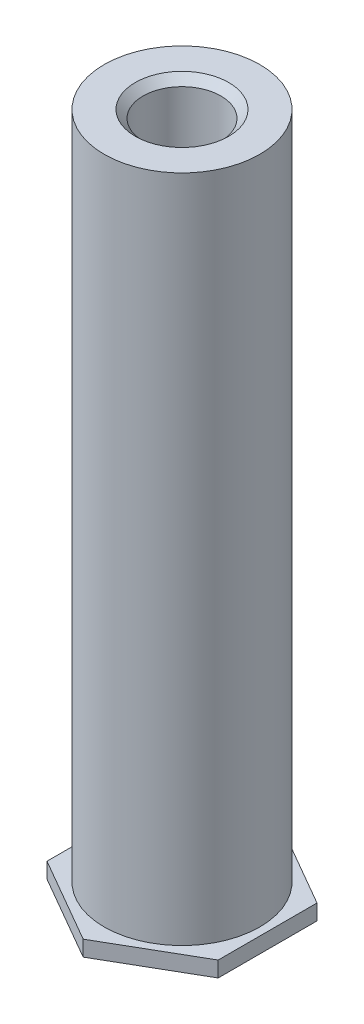
ISO-10303-21;
HEADER;
FILE_DESCRIPTION(('STEP AP214'),'2;1');
FILE_NAME('part.step','',(''),(''),'','','');
FILE_SCHEMA(('AUTOMOTIVE_DESIGN { 1 0 10303 214 1 1 1 1 }'));
ENDSEC;
DATA;
#1=APPLICATION_CONTEXT('core data for automotive mechanical design processes');
#2=APPLICATION_PROTOCOL_DEFINITION('international standard','automotive_design',2000,#1);
#3=PRODUCT_CONTEXT('',#1,'mechanical');
#4=PRODUCT('Part','Part','',(#3));
#5=PRODUCT_RELATED_PRODUCT_CATEGORY('part','',(#4));
#6=PRODUCT_DEFINITION_FORMATION('','',#4);
#7=PRODUCT_DEFINITION_CONTEXT('part definition',#1,'design');
#8=PRODUCT_DEFINITION('design','',#6,#7);
#9=PRODUCT_DEFINITION_SHAPE('','',#8);
#10=(LENGTH_UNIT() NAMED_UNIT(*) SI_UNIT(.MILLI.,.METRE.));
#11=(NAMED_UNIT(*) PLANE_ANGLE_UNIT() SI_UNIT($,.RADIAN.));
#12=(NAMED_UNIT(*) SI_UNIT($,.STERADIAN.) SOLID_ANGLE_UNIT());
#13=UNCERTAINTY_MEASURE_WITH_UNIT(LENGTH_MEASURE(1.E-05),#10,'distance_accuracy_value','');
#14=(GEOMETRIC_REPRESENTATION_CONTEXT(3) GLOBAL_UNCERTAINTY_ASSIGNED_CONTEXT((#13)) GLOBAL_UNIT_ASSIGNED_CONTEXT((#10,
#11,#12)) REPRESENTATION_CONTEXT('',''));
#15=CARTESIAN_POINT('',(0.,0.,0.));
#16=DIRECTION('',(0.,0.,1.));
#17=DIRECTION('',(1.,0.,0.));
#18=AXIS2_PLACEMENT_3D('',#15,#16,#17);
#19=CARTESIAN_POINT('',(-2.74999999999998,0.5,1.5877132402715));
#20=DIRECTION('',(0.499999999999995,0.,-0.866025403784442));
#21=DIRECTION('',(-0.866025403784442,0.,-0.499999999999995));
#22=AXIS2_PLACEMENT_3D('',#19,#20,#21);
#23=PLANE('',#22);
#24=DIRECTION('',(0.866025403784442,0.,0.499999999999995));
#25=VECTOR('',#24,1.);
#26=CARTESIAN_POINT('',(-2.74999999999998,0.,1.5877132402715));
#27=LINE('',#26,#25);
#28=CARTESIAN_POINT('',(-2.74999999999998,0.,1.5877132402715));
#29=VERTEX_POINT('',#28);
#30=CARTESIAN_POINT('',(0.,0.,3.17542648054294));
#31=VERTEX_POINT('',#30);
#32=EDGE_CURVE('E127',#29,#31,#27,.T.);
#33=ORIENTED_EDGE('',*,*,#32,.T.);
#34=DIRECTION('',(0.,-1.,0.));
#35=VECTOR('',#34,1.);
#36=CARTESIAN_POINT('',(0.,0.5,3.17542648054294));
#37=LINE('',#36,#35);
#38=CARTESIAN_POINT('',(0.,0.5,3.17542648054294));
#39=VERTEX_POINT('',#38);
#40=EDGE_CURVE('E42',#39,#31,#37,.T.);
#41=ORIENTED_EDGE('',*,*,#40,.F.);
#42=DIRECTION('',(0.866025403784442,0.,0.499999999999995));
#43=VECTOR('',#42,1.);
#44=CARTESIAN_POINT('',(-2.74999999999998,0.5,1.5877132402715));
#45=LINE('',#44,#43);
#46=CARTESIAN_POINT('',(-2.74999999999998,0.5,1.5877132402715));
#47=VERTEX_POINT('',#46);
#48=EDGE_CURVE('E138',#47,#39,#45,.T.);
#49=ORIENTED_EDGE('',*,*,#48,.F.);
#50=DIRECTION('',(0.,-1.,0.));
#51=VECTOR('',#50,1.);
#52=CARTESIAN_POINT('',(-2.74999999999998,0.5,1.5877132402715));
#53=LINE('',#52,#51);
#54=EDGE_CURVE('E123',#47,#29,#53,.T.);
#55=ORIENTED_EDGE('',*,*,#54,.T.);
#56=EDGE_LOOP('',(#33,#41,#49,#55));
#57=FACE_BOUND('',#56,.T.);
#58=ADVANCED_FACE('F39',(#57),#23,.F.);
#59=CARTESIAN_POINT('',(0.,0.5,3.17542648054294));
#60=DIRECTION('',(-0.500000000000001,0.,-0.866025403784438));
#61=DIRECTION('',(-0.866025403784438,0.,0.500000000000001));
#62=AXIS2_PLACEMENT_3D('',#59,#60,#61);
#63=PLANE('',#62);
#64=DIRECTION('',(0.866025403784438,0.,-0.500000000000001));
#65=VECTOR('',#64,1.);
#66=CARTESIAN_POINT('',(0.,0.,3.17542648054294));
#67=LINE('',#66,#65);
#68=CARTESIAN_POINT('',(2.75000000000001,0.,1.58771324027147));
#69=VERTEX_POINT('',#68);
#70=EDGE_CURVE('E130',#31,#69,#67,.T.);
#71=ORIENTED_EDGE('',*,*,#70,.T.);
#72=DIRECTION('',(0.,-1.,0.));
#73=VECTOR('',#72,1.);
#74=CARTESIAN_POINT('',(2.75000000000001,0.5,1.58771324027147));
#75=LINE('',#74,#73);
#76=CARTESIAN_POINT('',(2.75000000000001,0.5,1.58771324027147));
#77=VERTEX_POINT('',#76);
#78=EDGE_CURVE('E141',#77,#69,#75,.T.);
#79=ORIENTED_EDGE('',*,*,#78,.F.);
#80=DIRECTION('',(0.866025403784438,0.,-0.500000000000001));
#81=VECTOR('',#80,1.);
#82=CARTESIAN_POINT('',(0.,0.5,3.17542648054294));
#83=LINE('',#82,#81);
#84=EDGE_CURVE('E95',#39,#77,#83,.T.);
#85=ORIENTED_EDGE('',*,*,#84,.F.);
#86=ORIENTED_EDGE('',*,*,#40,.T.);
#87=EDGE_LOOP('',(#71,#79,#85,#86));
#88=FACE_BOUND('',#87,.T.);
#89=ADVANCED_FACE('F146',(#88),#63,.F.);
#90=CARTESIAN_POINT('',(2.75000000000001,0.5,1.58771324027147));
#91=DIRECTION('',(-1.,0.,0.));
#92=DIRECTION('',(0.,0.,1.));
#93=AXIS2_PLACEMENT_3D('',#90,#91,#92);
#94=PLANE('',#93);
#95=DIRECTION('',(0.,0.,-1.));
#96=VECTOR('',#95,1.);
#97=CARTESIAN_POINT('',(2.75000000000001,0.,1.58771324027147));
#98=LINE('',#97,#96);
#99=CARTESIAN_POINT('',(2.74999999999999,0.,-1.58771324027148));
#100=VERTEX_POINT('',#99);
#101=EDGE_CURVE('E133',#69,#100,#98,.T.);
#102=ORIENTED_EDGE('',*,*,#101,.T.);
#103=DIRECTION('',(0.,-1.,0.));
#104=VECTOR('',#103,1.);
#105=CARTESIAN_POINT('',(2.74999999999999,0.5,-1.58771324027148));
#106=LINE('',#105,#104);
#107=CARTESIAN_POINT('',(2.74999999999999,0.5,-1.58771324027148));
#108=VERTEX_POINT('',#107);
#109=EDGE_CURVE('E118',#108,#100,#106,.T.);
#110=ORIENTED_EDGE('',*,*,#109,.F.);
#111=DIRECTION('',(0.,0.,-1.));
#112=VECTOR('',#111,1.);
#113=CARTESIAN_POINT('',(2.75000000000001,0.5,1.58771324027147));
#114=LINE('',#113,#112);
#115=EDGE_CURVE('E109',#77,#108,#114,.T.);
#116=ORIENTED_EDGE('',*,*,#115,.F.);
#117=ORIENTED_EDGE('',*,*,#78,.T.);
#118=EDGE_LOOP('',(#102,#110,#116,#117));
#119=FACE_BOUND('',#118,.T.);
#120=ADVANCED_FACE('F152',(#119),#94,.F.);
#121=CARTESIAN_POINT('',(2.74999999999999,0.5,-1.58771324027148));
#122=DIRECTION('',(-0.499999999999995,0.,0.866025403784441));
#123=DIRECTION('',(0.866025403784442,0.,0.499999999999995));
#124=AXIS2_PLACEMENT_3D('',#121,#122,#123);
#125=PLANE('',#124);
#126=DIRECTION('',(-0.866025403784441,0.,-0.499999999999995));
#127=VECTOR('',#126,1.);
#128=CARTESIAN_POINT('',(2.74999999999999,0.,-1.58771324027148));
#129=LINE('',#128,#127);
#130=CARTESIAN_POINT('',(0.,0.,-3.17542648054294));
#131=VERTEX_POINT('',#130);
#132=EDGE_CURVE('E117',#100,#131,#129,.T.);
#133=ORIENTED_EDGE('',*,*,#132,.T.);
#134=DIRECTION('',(0.,-1.,0.));
#135=VECTOR('',#134,1.);
#136=CARTESIAN_POINT('',(0.,0.5,-3.17542648054294));
#137=LINE('',#136,#135);
#138=CARTESIAN_POINT('',(0.,0.5,-3.17542648054294));
#139=VERTEX_POINT('',#138);
#140=EDGE_CURVE('E114',#139,#131,#137,.T.);
#141=ORIENTED_EDGE('',*,*,#140,.F.);
#142=DIRECTION('',(-0.866025403784441,0.,-0.499999999999995));
#143=VECTOR('',#142,1.);
#144=CARTESIAN_POINT('',(2.74999999999999,0.5,-1.58771324027148));
#145=LINE('',#144,#143);
#146=EDGE_CURVE('E103',#108,#139,#145,.T.);
#147=ORIENTED_EDGE('',*,*,#146,.F.);
#148=ORIENTED_EDGE('',*,*,#109,.T.);
#149=EDGE_LOOP('',(#133,#141,#147,#148));
#150=FACE_BOUND('',#149,.T.);
#151=ADVANCED_FACE('F115',(#150),#125,.F.);
#152=CARTESIAN_POINT('',(0.,0.5,-3.17542648054294));
#153=DIRECTION('',(0.500000000000007,0.,0.866025403784435));
#154=DIRECTION('',(0.866025403784435,0.,-0.500000000000007));
#155=AXIS2_PLACEMENT_3D('',#152,#153,#154);
#156=PLANE('',#155);
#157=DIRECTION('',(-0.866025403784435,0.,0.500000000000007));
#158=VECTOR('',#157,1.);
#159=CARTESIAN_POINT('',(0.,0.,-3.17542648054294));
#160=LINE('',#159,#158);
#161=CARTESIAN_POINT('',(-2.75000000000002,0.,-1.58771324027145));
#162=VERTEX_POINT('',#161);
#163=EDGE_CURVE('E80',#131,#162,#160,.T.);
#164=ORIENTED_EDGE('',*,*,#163,.T.);
#165=DIRECTION('',(0.,-1.,0.));
#166=VECTOR('',#165,1.);
#167=CARTESIAN_POINT('',(-2.75000000000002,0.5,-1.58771324027145));
#168=LINE('',#167,#166);
#169=CARTESIAN_POINT('',(-2.75000000000002,0.5,-1.58771324027145));
#170=VERTEX_POINT('',#169);
#171=EDGE_CURVE('E119',#170,#162,#168,.T.);
#172=ORIENTED_EDGE('',*,*,#171,.F.);
#173=DIRECTION('',(-0.866025403784435,0.,0.500000000000007));
#174=VECTOR('',#173,1.);
#175=CARTESIAN_POINT('',(0.,0.5,-3.17542648054294));
#176=LINE('',#175,#174);
#177=EDGE_CURVE('E107',#139,#170,#176,.T.);
#178=ORIENTED_EDGE('',*,*,#177,.F.);
#179=ORIENTED_EDGE('',*,*,#140,.T.);
#180=EDGE_LOOP('',(#164,#172,#178,#179));
#181=FACE_BOUND('',#180,.T.);
#182=ADVANCED_FACE('F121',(#181),#156,.F.);
#183=CARTESIAN_POINT('',(-2.75000000000002,0.5,-1.58771324027145));
#184=DIRECTION('',(1.,0.,0.));
#185=DIRECTION('',(0.,0.,-1.));
#186=AXIS2_PLACEMENT_3D('',#183,#184,#185);
#187=PLANE('',#186);
#188=DIRECTION('',(0.,0.,1.));
#189=VECTOR('',#188,1.);
#190=CARTESIAN_POINT('',(-2.75000000000002,0.,-1.58771324027145));
#191=LINE('',#190,#189);
#192=EDGE_CURVE('E86',#162,#29,#191,.T.);
#193=ORIENTED_EDGE('',*,*,#192,.T.);
#194=ORIENTED_EDGE('',*,*,#54,.F.);
#195=DIRECTION('',(0.,0.,1.));
#196=VECTOR('',#195,1.);
#197=CARTESIAN_POINT('',(-2.75000000000002,0.5,-1.58771324027145));
#198=LINE('',#197,#196);
#199=EDGE_CURVE('E56',#170,#47,#198,.T.);
#200=ORIENTED_EDGE('',*,*,#199,.F.);
#201=ORIENTED_EDGE('',*,*,#171,.T.);
#202=EDGE_LOOP('',(#193,#194,#200,#201));
#203=FACE_BOUND('',#202,.T.);
#204=ADVANCED_FACE('F184',(#203),#187,.F.);
#205=CARTESIAN_POINT('',(0.,0.5,0.));
#206=DIRECTION('',(0.,1.,0.));
#207=DIRECTION('',(0.,0.,1.));
#208=AXIS2_PLACEMENT_3D('',#205,#206,#207);
#209=PLANE('',#208);
#210=CARTESIAN_POINT('',(0.,0.5,0.));
#211=DIRECTION('',(0.,1.,0.));
#212=DIRECTION('',(0.,0.,1.));
#213=AXIS2_PLACEMENT_3D('',#210,#211,#212);
#214=CIRCLE('',#213,2.5);
#215=CARTESIAN_POINT('',(0.,0.5,2.5));
#216=VERTEX_POINT('',#215);
#217=EDGE_CURVE('E11',#216,#216,#214,.T.);
#218=ORIENTED_EDGE('',*,*,#217,.F.);
#219=EDGE_LOOP('',(#218));
#220=FACE_BOUND('',#219,.T.);
#221=ORIENTED_EDGE('',*,*,#48,.T.);
#222=ORIENTED_EDGE('',*,*,#84,.T.);
#223=ORIENTED_EDGE('',*,*,#115,.T.);
#224=ORIENTED_EDGE('',*,*,#146,.T.);
#225=ORIENTED_EDGE('',*,*,#177,.T.);
#226=ORIENTED_EDGE('',*,*,#199,.T.);
#227=EDGE_LOOP('',(#221,#222,#223,#224,#225,#226));
#228=FACE_BOUND('',#227,.T.);
#229=ADVANCED_FACE('F105',(#220,#228),#209,.T.);
#230=CARTESIAN_POINT('',(0.,0.,0.));
#231=DIRECTION('',(0.,1.,0.));
#232=DIRECTION('',(0.,0.,1.));
#233=AXIS2_PLACEMENT_3D('',#230,#231,#232);
#234=PLANE('',#233);
#235=ORIENTED_EDGE('',*,*,#32,.F.);
#236=ORIENTED_EDGE('',*,*,#192,.F.);
#237=ORIENTED_EDGE('',*,*,#163,.F.);
#238=ORIENTED_EDGE('',*,*,#132,.F.);
#239=ORIENTED_EDGE('',*,*,#101,.F.);
#240=ORIENTED_EDGE('',*,*,#70,.F.);
#241=EDGE_LOOP('',(#235,#236,#237,#238,#239,#240));
#242=FACE_BOUND('',#241,.T.);
#243=ADVANCED_FACE('F151',(#242),#234,.F.);
#244=CARTESIAN_POINT('',(0.,22.,0.));
#245=DIRECTION('',(0.,-1.,0.));
#246=DIRECTION('',(0.,0.,-1.));
#247=AXIS2_PLACEMENT_3D('',#244,#245,#246);
#248=CYLINDRICAL_SURFACE('',#247,2.5);
#249=CARTESIAN_POINT('',(0.,22.,0.));
#250=DIRECTION('',(0.,1.,0.));
#251=DIRECTION('',(0.,0.,1.));
#252=AXIS2_PLACEMENT_3D('',#249,#250,#251);
#253=CIRCLE('',#252,2.5);
#254=CARTESIAN_POINT('',(0.,22.,2.5));
#255=VERTEX_POINT('',#254);
#256=EDGE_CURVE('E131',#255,#255,#253,.T.);
#257=ORIENTED_EDGE('',*,*,#256,.F.);
#258=EDGE_LOOP('',(#257));
#259=FACE_BOUND('',#258,.T.);
#260=ORIENTED_EDGE('',*,*,#217,.T.);
#261=EDGE_LOOP('',(#260));
#262=FACE_BOUND('',#261,.T.);
#263=ADVANCED_FACE('F174',(#259,#262),#248,.T.);
#264=CARTESIAN_POINT('',(0.,22.,0.));
#265=DIRECTION('',(0.,1.,0.));
#266=DIRECTION('',(0.,0.,1.));
#267=AXIS2_PLACEMENT_3D('',#264,#265,#266);
#268=PLANE('',#267);
#269=CARTESIAN_POINT('',(0.,22.,0.));
#270=DIRECTION('',(0.,1.,0.));
#271=DIRECTION('',(0.,0.,1.));
#272=AXIS2_PLACEMENT_3D('',#269,#270,#271);
#273=CIRCLE('',#272,1.5);
#274=CARTESIAN_POINT('',(0.,22.,1.5));
#275=VERTEX_POINT('',#274);
#276=EDGE_CURVE('E164',#275,#275,#273,.T.);
#277=ORIENTED_EDGE('',*,*,#276,.F.);
#278=EDGE_LOOP('',(#277));
#279=FACE_BOUND('',#278,.T.);
#280=ORIENTED_EDGE('',*,*,#256,.T.);
#281=EDGE_LOOP('',(#280));
#282=FACE_BOUND('',#281,.T.);
#283=ADVANCED_FACE('F170',(#279,#282),#268,.T.);
#284=CARTESIAN_POINT('',(0.,14.5,0.));
#285=DIRECTION('',(0.,1.,0.));
#286=DIRECTION('',(0.,0.,1.));
#287=AXIS2_PLACEMENT_3D('',#284,#285,#286);
#288=CONICAL_SURFACE('',#287,1.24999999999999,1.02974425867665);
#289=CARTESIAN_POINT('',(0.,13.7489242262156,0.));
#290=VERTEX_POINT('',#289);
#291=VERTEX_LOOP('',#290);
#292=FACE_BOUND('',#291,.T.);
#293=CARTESIAN_POINT('',(0.,14.5,0.));
#294=DIRECTION('',(0.,1.,0.));
#295=DIRECTION('',(0.,0.,1.));
#296=AXIS2_PLACEMENT_3D('',#293,#294,#295);
#297=CIRCLE('',#296,1.24999999999999);
#298=CARTESIAN_POINT('',(0.,14.5,1.24999999999999));
#299=VERTEX_POINT('',#298);
#300=EDGE_CURVE('E158',#299,#299,#297,.T.);
#301=ORIENTED_EDGE('',*,*,#300,.T.);
#302=EDGE_LOOP('',(#301));
#303=FACE_BOUND('',#302,.T.);
#304=ADVANCED_FACE('F173',(#292,#303),#288,.F.);
#305=CARTESIAN_POINT('',(0.,22.,0.));
#306=DIRECTION('',(0.,1.,0.));
#307=DIRECTION('',(0.,0.,1.));
#308=AXIS2_PLACEMENT_3D('',#305,#306,#307);
#309=CYLINDRICAL_SURFACE('',#308,1.24999999999999);
#310=ORIENTED_EDGE('',*,*,#300,.F.);
#311=EDGE_LOOP('',(#310));
#312=FACE_BOUND('',#311,.T.);
#313=CARTESIAN_POINT('',(0.,21.75,0.));
#314=DIRECTION('',(0.,1.,0.));
#315=DIRECTION('',(0.,0.,1.));
#316=AXIS2_PLACEMENT_3D('',#313,#314,#315);
#317=CIRCLE('',#316,1.25);
#318=CARTESIAN_POINT('',(0.,21.75,1.25));
#319=VERTEX_POINT('',#318);
#320=EDGE_CURVE('E161',#319,#319,#317,.T.);
#321=ORIENTED_EDGE('',*,*,#320,.T.);
#322=EDGE_LOOP('',(#321));
#323=FACE_BOUND('',#322,.T.);
#324=ADVANCED_FACE('F243',(#312,#323),#309,.F.);
#325=CARTESIAN_POINT('',(0.,22.,0.));
#326=DIRECTION('',(0.,1.,0.));
#327=DIRECTION('',(0.,0.,1.));
#328=AXIS2_PLACEMENT_3D('',#325,#326,#327);
#329=CONICAL_SURFACE('',#328,1.5,0.785398163397449);
#330=ORIENTED_EDGE('',*,*,#320,.F.);
#331=EDGE_LOOP('',(#330));
#332=FACE_BOUND('',#331,.T.);
#333=ORIENTED_EDGE('',*,*,#276,.T.);
#334=EDGE_LOOP('',(#333));
#335=FACE_BOUND('',#334,.T.);
#336=ADVANCED_FACE('F168',(#332,#335),#329,.F.);
#337=CLOSED_SHELL('',(#58,#89,#120,#151,#182,#204,#229,#243,#263,#283,#304,#324,#336));
#338=MANIFOLD_SOLID_BREP('B2',#337);
#339=ADVANCED_BREP_SHAPE_REPRESENTATION('',(#18,#338),#14);
#340=SHAPE_DEFINITION_REPRESENTATION(#9,#339);
ENDSEC;
END-ISO-10303-21;
